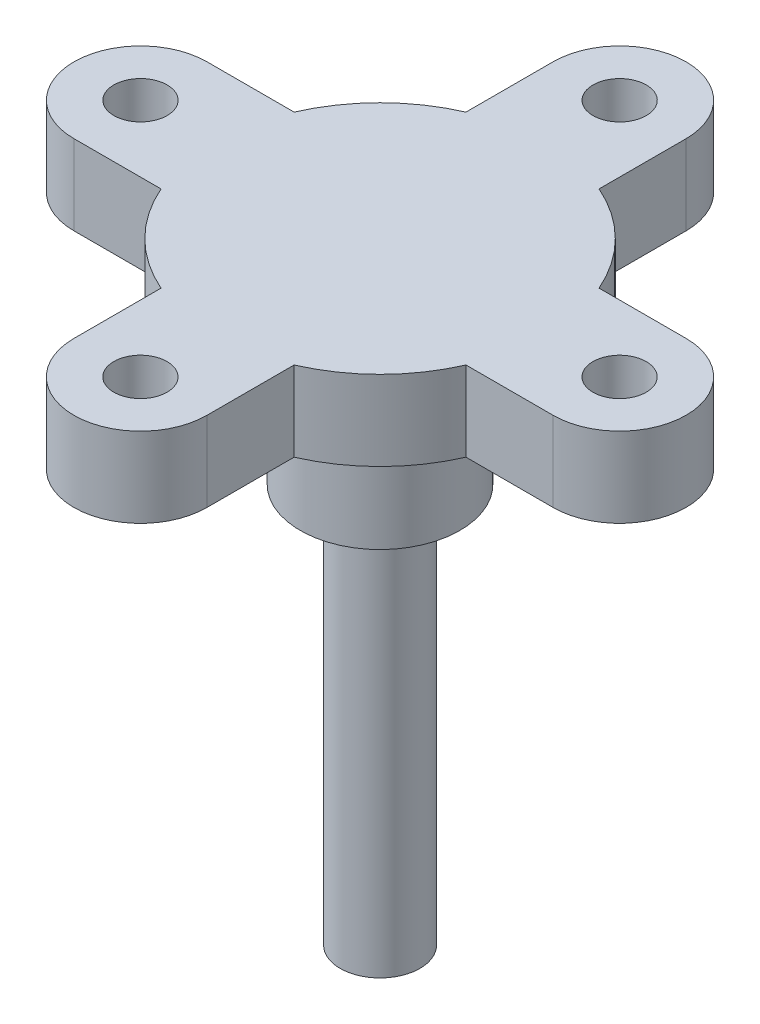
ISO-10303-21;
HEADER;
FILE_DESCRIPTION(('STEP AP214'),'2;1');
FILE_NAME('part.step','',(''),(''),'','','');
FILE_SCHEMA(('AUTOMOTIVE_DESIGN { 1 0 10303 214 1 1 1 1 }'));
ENDSEC;
DATA;
#1=APPLICATION_CONTEXT('core data for automotive mechanical design processes');
#2=APPLICATION_PROTOCOL_DEFINITION('international standard','automotive_design',2000,#1);
#3=PRODUCT_CONTEXT('',#1,'mechanical');
#4=PRODUCT('Part','Part','',(#3));
#5=PRODUCT_RELATED_PRODUCT_CATEGORY('part','',(#4));
#6=PRODUCT_DEFINITION_FORMATION('','',#4);
#7=PRODUCT_DEFINITION_CONTEXT('part definition',#1,'design');
#8=PRODUCT_DEFINITION('design','',#6,#7);
#9=PRODUCT_DEFINITION_SHAPE('','',#8);
#10=(LENGTH_UNIT() NAMED_UNIT(*) SI_UNIT(.MILLI.,.METRE.));
#11=(NAMED_UNIT(*) PLANE_ANGLE_UNIT() SI_UNIT($,.RADIAN.));
#12=(NAMED_UNIT(*) SI_UNIT($,.STERADIAN.) SOLID_ANGLE_UNIT());
#13=UNCERTAINTY_MEASURE_WITH_UNIT(LENGTH_MEASURE(1.E-05),#10,'distance_accuracy_value','');
#14=(GEOMETRIC_REPRESENTATION_CONTEXT(3) GLOBAL_UNCERTAINTY_ASSIGNED_CONTEXT((#13)) GLOBAL_UNIT_ASSIGNED_CONTEXT((#10,
#11,#12)) REPRESENTATION_CONTEXT('',''));
#15=CARTESIAN_POINT('',(0.,0.,0.));
#16=DIRECTION('',(0.,0.,1.));
#17=DIRECTION('',(1.,0.,0.));
#18=AXIS2_PLACEMENT_3D('',#15,#16,#17);
#19=CARTESIAN_POINT('',(-0.000427746550133779,-281.127907150294,0.0033078069265437));
#20=DIRECTION('',(0.,-1.,0.));
#21=DIRECTION('',(0.,0.,-1.));
#22=AXIS2_PLACEMENT_3D('',#19,#20,#21);
#23=PLANE('',#22);
#24=CARTESIAN_POINT('',(-0.000427746550133779,-281.127907150294,0.00330780692654162));
#25=DIRECTION('',(0.,-1.,0.));
#26=DIRECTION('',(0.,0.,-1.));
#27=AXIS2_PLACEMENT_3D('',#24,#25,#26);
#28=CIRCLE('',#27,9.);
#29=CARTESIAN_POINT('',(-0.000427746550133779,-281.127907150294,-8.99669219307346));
#30=VERTEX_POINT('',#29);
#31=EDGE_CURVE('E509',#30,#30,#28,.T.);
#32=ORIENTED_EDGE('',*,*,#31,.F.);
#33=EDGE_LOOP('',(#32));
#34=FACE_BOUND('',#33,.T.);
#35=CARTESIAN_POINT('',(0.00806534663140095,-281.127907150294,-26.9966921930729));
#36=DIRECTION('',(0.,-1.,0.));
#37=DIRECTION('',(0.,0.,-1.));
#38=AXIS2_PLACEMENT_3D('',#35,#36,#37);
#39=CIRCLE('',#38,3.);
#40=CARTESIAN_POINT('',(0.00806534663140095,-281.127907150294,-29.9966921930729));
#41=VERTEX_POINT('',#40);
#42=EDGE_CURVE('E489',#41,#41,#39,.T.);
#43=ORIENTED_EDGE('',*,*,#42,.F.);
#44=EDGE_LOOP('',(#43));
#45=FACE_BOUND('',#44,.T.);
#46=CARTESIAN_POINT('',(-0.000427746550133779,-281.127907150294,27.0118009001086));
#47=DIRECTION('',(0.,-1.,0.));
#48=DIRECTION('',(0.,0.,-1.));
#49=AXIS2_PLACEMENT_3D('',#46,#47,#48);
#50=CIRCLE('',#49,3.);
#51=CARTESIAN_POINT('',(-0.000427746550133779,-281.127907150294,24.0118009001086));
#52=VERTEX_POINT('',#51);
#53=EDGE_CURVE('E221',#52,#52,#50,.T.);
#54=ORIENTED_EDGE('',*,*,#53,.F.);
#55=EDGE_LOOP('',(#54));
#56=FACE_BOUND('',#55,.T.);
#57=CARTESIAN_POINT('',(-0.000427746550133779,-281.127907150294,0.0033078069265437));
#58=DIRECTION('',(0.,-1.,0.));
#59=DIRECTION('',(0.,0.,-1.));
#60=AXIS2_PLACEMENT_3D('',#57,#58,#59);
#61=CIRCLE('',#60,18.75);
#62=CARTESIAN_POINT('',(7.49957225344975,-281.127907150294,-17.1813510491579));
#63=VERTEX_POINT('',#62);
#64=CARTESIAN_POINT('',(17.1842311095342,-281.127907150294,-7.49669219307352));
#65=VERTEX_POINT('',#64);
#66=EDGE_CURVE('E263',#63,#65,#61,.T.);
#67=ORIENTED_EDGE('',*,*,#66,.T.);
#68=DIRECTION('',(1.,0.,0.));
#69=VECTOR('',#68,1.);
#70=CARTESIAN_POINT('',(17.1842311095342,-281.127907150294,-7.49669219307352));
#71=LINE('',#70,#69);
#72=CARTESIAN_POINT('',(26.9995722534498,-281.127907150294,-7.49669219307355));
#73=VERTEX_POINT('',#72);
#74=EDGE_CURVE('E151',#65,#73,#71,.T.);
#75=ORIENTED_EDGE('',*,*,#74,.T.);
#76=CARTESIAN_POINT('',(26.9995722534499,-281.127907150294,0.00330780692616454));
#77=DIRECTION('',(0.,-1.,0.));
#78=DIRECTION('',(0.,0.,-1.));
#79=AXIS2_PLACEMENT_3D('',#76,#77,#78);
#80=CIRCLE('',#79,7.5);
#81=CARTESIAN_POINT('',(26.9995722534499,-281.127907150294,7.50330780692616));
#82=VERTEX_POINT('',#81);
#83=EDGE_CURVE('E414',#73,#82,#80,.T.);
#84=ORIENTED_EDGE('',*,*,#83,.T.);
#85=DIRECTION('',(-1.,0.,0.));
#86=VECTOR('',#85,1.);
#87=CARTESIAN_POINT('',(17.1842311095343,-281.127907150294,7.50330780692648));
#88=LINE('',#87,#86);
#89=CARTESIAN_POINT('',(17.1842311095343,-281.127907150294,7.50330780692648));
#90=VERTEX_POINT('',#89);
#91=EDGE_CURVE('E417',#82,#90,#88,.T.);
#92=ORIENTED_EDGE('',*,*,#91,.T.);
#93=CARTESIAN_POINT('',(-0.000427746550133779,-281.127907150294,0.0033078069265437));
#94=DIRECTION('',(0.,-1.,0.));
#95=DIRECTION('',(0.,0.,-1.));
#96=AXIS2_PLACEMENT_3D('',#93,#94,#95);
#97=CIRCLE('',#96,18.75);
#98=CARTESIAN_POINT('',(7.49957225344987,-281.127907150294,17.1879666630109));
#99=VERTEX_POINT('',#98);
#100=EDGE_CURVE('E421',#90,#99,#97,.T.);
#101=ORIENTED_EDGE('',*,*,#100,.T.);
#102=DIRECTION('',(0.,0.,1.));
#103=VECTOR('',#102,1.);
#104=CARTESIAN_POINT('',(7.49957225344987,-281.127907150294,17.1879666630109));
#105=LINE('',#104,#103);
#106=CARTESIAN_POINT('',(7.49957225344987,-281.127907150294,27.0033078068387));
#107=VERTEX_POINT('',#106);
#108=EDGE_CURVE('E428',#99,#107,#105,.T.);
#109=ORIENTED_EDGE('',*,*,#108,.T.);
#110=CARTESIAN_POINT('',(-0.000427746550085093,-281.127907150294,27.0118009001086));
#111=DIRECTION('',(0.,-1.,0.));
#112=DIRECTION('',(0.,0.,-1.));
#113=AXIS2_PLACEMENT_3D('',#110,#111,#112);
#114=CIRCLE('',#113,7.50000480884063);
#115=CARTESIAN_POINT('',(-7.50042774655014,-281.127907150294,27.0033078069265));
#116=VERTEX_POINT('',#115);
#117=EDGE_CURVE('E431',#107,#116,#114,.T.);
#118=ORIENTED_EDGE('',*,*,#117,.T.);
#119=DIRECTION('',(0.,0.,-1.));
#120=VECTOR('',#119,1.);
#121=CARTESIAN_POINT('',(-7.50042774655013,-281.127907150294,17.1879666630109));
#122=LINE('',#121,#120);
#123=CARTESIAN_POINT('',(-7.50042774655013,-281.127907150294,17.1879666630109));
#124=VERTEX_POINT('',#123);
#125=EDGE_CURVE('E434',#116,#124,#122,.T.);
#126=ORIENTED_EDGE('',*,*,#125,.T.);
#127=CARTESIAN_POINT('',(-0.000427746550133779,-281.127907150294,0.0033078069265437));
#128=DIRECTION('',(0.,-1.,0.));
#129=DIRECTION('',(0.,0.,-1.));
#130=AXIS2_PLACEMENT_3D('',#127,#128,#129);
#131=CIRCLE('',#130,18.75);
#132=CARTESIAN_POINT('',(-17.1850866026345,-281.127907150294,7.50330780692673));
#133=VERTEX_POINT('',#132);
#134=EDGE_CURVE('E437',#124,#133,#131,.T.);
#135=ORIENTED_EDGE('',*,*,#134,.T.);
#136=DIRECTION('',(-1.,0.,0.));
#137=VECTOR('',#136,1.);
#138=CARTESIAN_POINT('',(-17.1850866026345,-281.127907150294,7.50330780692672));
#139=LINE('',#138,#137);
#140=CARTESIAN_POINT('',(-27.00042774655,-281.127907150294,7.50330780692692));
#141=VERTEX_POINT('',#140);
#142=EDGE_CURVE('E440',#133,#141,#139,.T.);
#143=ORIENTED_EDGE('',*,*,#142,.T.);
#144=CARTESIAN_POINT('',(-27.0004277465501,-281.127907150294,0.00330780692710724));
#145=DIRECTION('',(0.,-1.,0.));
#146=DIRECTION('',(0.,0.,-1.));
#147=AXIS2_PLACEMENT_3D('',#144,#145,#146);
#148=CIRCLE('',#147,7.50000000000005);
#149=CARTESIAN_POINT('',(-27.0004277465501,-281.127907150294,-7.49669219307294));
#150=VERTEX_POINT('',#149);
#151=EDGE_CURVE('E443',#141,#150,#148,.T.);
#152=ORIENTED_EDGE('',*,*,#151,.T.);
#153=DIRECTION('',(1.,0.,0.));
#154=VECTOR('',#153,1.);
#155=CARTESIAN_POINT('',(-17.1850866026346,-281.127907150294,-7.49669219307328));
#156=LINE('',#155,#154);
#157=CARTESIAN_POINT('',(-17.1850866026346,-281.127907150294,-7.49669219307328));
#158=VERTEX_POINT('',#157);
#159=EDGE_CURVE('E446',#150,#158,#156,.T.);
#160=ORIENTED_EDGE('',*,*,#159,.T.);
#161=CARTESIAN_POINT('',(-0.000427746550133779,-281.127907150294,0.0033078069265437));
#162=DIRECTION('',(0.,-1.,0.));
#163=DIRECTION('',(0.,0.,-1.));
#164=AXIS2_PLACEMENT_3D('',#161,#162,#163);
#165=CIRCLE('',#164,18.75);
#166=CARTESIAN_POINT('',(-7.50042774655026,-281.127907150294,-17.1813510491578));
#167=VERTEX_POINT('',#166);
#168=EDGE_CURVE('E194',#158,#167,#165,.T.);
#169=ORIENTED_EDGE('',*,*,#168,.T.);
#170=DIRECTION('',(0.,0.,-1.));
#171=VECTOR('',#170,1.);
#172=CARTESIAN_POINT('',(-7.50042774655025,-281.127907150294,-17.1813510491578));
#173=LINE('',#172,#171);
#174=CARTESIAN_POINT('',(-7.50042774655032,-281.127907150294,-26.9966921930734));
#175=VERTEX_POINT('',#174);
#176=EDGE_CURVE('E188',#167,#175,#173,.T.);
#177=ORIENTED_EDGE('',*,*,#176,.T.);
#178=CARTESIAN_POINT('',(-0.000427746550605129,-281.127907150294,-26.9966921930735));
#179=DIRECTION('',(0.,-1.,0.));
#180=DIRECTION('',(0.,0.,-1.));
#181=AXIS2_PLACEMENT_3D('',#178,#179,#180);
#182=CIRCLE('',#181,7.5);
#183=CARTESIAN_POINT('',(7.4995722534494,-281.127907150294,-26.9966921930735));
#184=VERTEX_POINT('',#183);
#185=EDGE_CURVE('E192',#175,#184,#182,.T.);
#186=ORIENTED_EDGE('',*,*,#185,.T.);
#187=DIRECTION('',(0.,0.,1.));
#188=VECTOR('',#187,1.);
#189=CARTESIAN_POINT('',(7.49957225344975,-281.127907150294,-17.1813510491579));
#190=LINE('',#189,#188);
#191=EDGE_CURVE('E83',#184,#63,#190,.T.);
#192=ORIENTED_EDGE('',*,*,#191,.T.);
#193=EDGE_LOOP('',(#67,#75,#84,#92,#101,#109,#118,#126,#135,#143,#152,#160,#169,#177,#186,#192));
#194=FACE_BOUND('',#193,.T.);
#195=CARTESIAN_POINT('',(27.0080653466314,-281.127907150294,0.0118009001086267));
#196=DIRECTION('',(0.,-1.,0.));
#197=DIRECTION('',(0.,0.,-1.));
#198=AXIS2_PLACEMENT_3D('',#195,#196,#197);
#199=CIRCLE('',#198,3.);
#200=CARTESIAN_POINT('',(27.0080653466314,-281.127907150294,-2.98819909989138));
#201=VERTEX_POINT('',#200);
#202=EDGE_CURVE('E481',#201,#201,#199,.T.);
#203=ORIENTED_EDGE('',*,*,#202,.F.);
#204=EDGE_LOOP('',(#203));
#205=FACE_BOUND('',#204,.T.);
#206=CARTESIAN_POINT('',(-27.0004277465501,-281.127907150294,0.00330780692710754));
#207=DIRECTION('',(0.,-1.,0.));
#208=DIRECTION('',(0.,0.,-1.));
#209=AXIS2_PLACEMENT_3D('',#206,#207,#208);
#210=CIRCLE('',#209,3.);
#211=CARTESIAN_POINT('',(-27.0004277465501,-281.127907150294,-2.99669219307289));
#212=VERTEX_POINT('',#211);
#213=EDGE_CURVE('E497',#212,#212,#210,.T.);
#214=ORIENTED_EDGE('',*,*,#213,.F.);
#215=EDGE_LOOP('',(#214));
#216=FACE_BOUND('',#215,.T.);
#217=ADVANCED_FACE('F65',(#34,#45,#56,#194,#205,#216),#23,.T.);
#218=CARTESIAN_POINT('',(-0.000427746550134881,-272.127907150294,0.00330780692654481));
#219=DIRECTION('',(0.,-1.,0.));
#220=DIRECTION('',(0.,0.,-1.));
#221=AXIS2_PLACEMENT_3D('',#218,#219,#220);
#222=PLANE('',#221);
#223=CARTESIAN_POINT('',(-0.000427746550134881,-272.127907150294,0.00330780692654481));
#224=DIRECTION('',(0.,-1.,0.));
#225=DIRECTION('',(0.,0.,-1.));
#226=AXIS2_PLACEMENT_3D('',#223,#224,#225);
#227=CIRCLE('',#226,18.75);
#228=CARTESIAN_POINT('',(7.49957225344975,-272.127907150294,-17.1813510491579));
#229=VERTEX_POINT('',#228);
#230=CARTESIAN_POINT('',(17.1842311095342,-272.127907150294,-7.49669219307352));
#231=VERTEX_POINT('',#230);
#232=EDGE_CURVE('E216',#229,#231,#227,.T.);
#233=ORIENTED_EDGE('',*,*,#232,.F.);
#234=DIRECTION('',(0.,0.,1.));
#235=VECTOR('',#234,1.);
#236=CARTESIAN_POINT('',(7.49957225344975,-272.127907150294,-17.1813510491579));
#237=LINE('',#236,#235);
#238=CARTESIAN_POINT('',(7.49957225344939,-272.127907150294,-26.9966921930735));
#239=VERTEX_POINT('',#238);
#240=EDGE_CURVE('E142',#239,#229,#237,.T.);
#241=ORIENTED_EDGE('',*,*,#240,.F.);
#242=CARTESIAN_POINT('',(-0.000427746550606231,-272.127907150294,-26.9966921930735));
#243=DIRECTION('',(0.,-1.,0.));
#244=DIRECTION('',(0.,0.,-1.));
#245=AXIS2_PLACEMENT_3D('',#242,#243,#244);
#246=CIRCLE('',#245,7.5);
#247=CARTESIAN_POINT('',(-7.50042774655032,-272.127907150294,-26.9966921930734));
#248=VERTEX_POINT('',#247);
#249=EDGE_CURVE('E136',#248,#239,#246,.T.);
#250=ORIENTED_EDGE('',*,*,#249,.F.);
#251=DIRECTION('',(0.,0.,-1.));
#252=VECTOR('',#251,1.);
#253=CARTESIAN_POINT('',(-7.50042774655025,-272.127907150294,-17.1813510491578));
#254=LINE('',#253,#252);
#255=CARTESIAN_POINT('',(-7.50042774655026,-272.127907150294,-17.1813510491578));
#256=VERTEX_POINT('',#255);
#257=EDGE_CURVE('E203',#256,#248,#254,.T.);
#258=ORIENTED_EDGE('',*,*,#257,.F.);
#259=CARTESIAN_POINT('',(-0.000427746550134881,-272.127907150294,0.00330780692654481));
#260=DIRECTION('',(0.,-1.,0.));
#261=DIRECTION('',(0.,0.,-1.));
#262=AXIS2_PLACEMENT_3D('',#259,#260,#261);
#263=CIRCLE('',#262,18.75);
#264=CARTESIAN_POINT('',(-17.1850866026346,-272.127907150294,-7.49669219307328));
#265=VERTEX_POINT('',#264);
#266=EDGE_CURVE('E254',#265,#256,#263,.T.);
#267=ORIENTED_EDGE('',*,*,#266,.F.);
#268=DIRECTION('',(1.,0.,0.));
#269=VECTOR('',#268,1.);
#270=CARTESIAN_POINT('',(-17.1850866026346,-272.127907150294,-7.49669219307328));
#271=LINE('',#270,#269);
#272=CARTESIAN_POINT('',(-27.0004277465501,-272.127907150294,-7.49669219307294));
#273=VERTEX_POINT('',#272);
#274=EDGE_CURVE('E251',#273,#265,#271,.T.);
#275=ORIENTED_EDGE('',*,*,#274,.F.);
#276=CARTESIAN_POINT('',(-27.0004277465501,-272.127907150294,0.00330780692710834));
#277=DIRECTION('',(0.,-1.,0.));
#278=DIRECTION('',(0.,0.,-1.));
#279=AXIS2_PLACEMENT_3D('',#276,#277,#278);
#280=CIRCLE('',#279,7.50000000000005);
#281=CARTESIAN_POINT('',(-27.00042774655,-272.127907150294,7.50330780692693));
#282=VERTEX_POINT('',#281);
#283=EDGE_CURVE('E248',#282,#273,#280,.T.);
#284=ORIENTED_EDGE('',*,*,#283,.F.);
#285=DIRECTION('',(-1.,0.,0.));
#286=VECTOR('',#285,1.);
#287=CARTESIAN_POINT('',(-17.1850866026345,-272.127907150294,7.50330780692672));
#288=LINE('',#287,#286);
#289=CARTESIAN_POINT('',(-17.1850866026345,-272.127907150294,7.50330780692673));
#290=VERTEX_POINT('',#289);
#291=EDGE_CURVE('E245',#290,#282,#288,.T.);
#292=ORIENTED_EDGE('',*,*,#291,.F.);
#293=CARTESIAN_POINT('',(-0.000427746550134881,-272.127907150294,0.00330780692654481));
#294=DIRECTION('',(0.,-1.,0.));
#295=DIRECTION('',(0.,0.,-1.));
#296=AXIS2_PLACEMENT_3D('',#293,#294,#295);
#297=CIRCLE('',#296,18.75);
#298=CARTESIAN_POINT('',(-7.50042774655013,-272.127907150294,17.1879666630109));
#299=VERTEX_POINT('',#298);
#300=EDGE_CURVE('E242',#299,#290,#297,.T.);
#301=ORIENTED_EDGE('',*,*,#300,.F.);
#302=DIRECTION('',(0.,0.,-1.));
#303=VECTOR('',#302,1.);
#304=CARTESIAN_POINT('',(-7.50042774655013,-272.127907150294,17.1879666630109));
#305=LINE('',#304,#303);
#306=CARTESIAN_POINT('',(-7.50042774655014,-272.127907150294,27.0033078069265));
#307=VERTEX_POINT('',#306);
#308=EDGE_CURVE('E239',#307,#299,#305,.T.);
#309=ORIENTED_EDGE('',*,*,#308,.F.);
#310=CARTESIAN_POINT('',(-0.000427746550086195,-272.127907150294,27.0118009001086));
#311=DIRECTION('',(0.,-1.,0.));
#312=DIRECTION('',(0.,0.,-1.));
#313=AXIS2_PLACEMENT_3D('',#310,#311,#312);
#314=CIRCLE('',#313,7.50000480884063);
#315=CARTESIAN_POINT('',(7.49957225344987,-272.127907150294,27.0033078068387));
#316=VERTEX_POINT('',#315);
#317=EDGE_CURVE('E236',#316,#307,#314,.T.);
#318=ORIENTED_EDGE('',*,*,#317,.F.);
#319=DIRECTION('',(0.,0.,1.));
#320=VECTOR('',#319,1.);
#321=CARTESIAN_POINT('',(7.49957225344987,-272.127907150294,17.1879666630109));
#322=LINE('',#321,#320);
#323=CARTESIAN_POINT('',(7.49957225344986,-272.127907150294,17.1879666630109));
#324=VERTEX_POINT('',#323);
#325=EDGE_CURVE('E233',#324,#316,#322,.T.);
#326=ORIENTED_EDGE('',*,*,#325,.F.);
#327=CARTESIAN_POINT('',(-0.000427746550134881,-272.127907150294,0.00330780692654481));
#328=DIRECTION('',(0.,-1.,0.));
#329=DIRECTION('',(0.,0.,-1.));
#330=AXIS2_PLACEMENT_3D('',#327,#328,#329);
#331=CIRCLE('',#330,18.75);
#332=CARTESIAN_POINT('',(17.1842311095343,-272.127907150294,7.50330780692648));
#333=VERTEX_POINT('',#332);
#334=EDGE_CURVE('E230',#333,#324,#331,.T.);
#335=ORIENTED_EDGE('',*,*,#334,.F.);
#336=DIRECTION('',(-1.,0.,0.));
#337=VECTOR('',#336,1.);
#338=CARTESIAN_POINT('',(17.1842311095343,-272.127907150294,7.50330780692648));
#339=LINE('',#338,#337);
#340=CARTESIAN_POINT('',(26.9995722534499,-272.127907150294,7.50330780692617));
#341=VERTEX_POINT('',#340);
#342=EDGE_CURVE('E227',#341,#333,#339,.T.);
#343=ORIENTED_EDGE('',*,*,#342,.F.);
#344=CARTESIAN_POINT('',(26.9995722534499,-272.127907150294,0.00330780692616564));
#345=DIRECTION('',(0.,-1.,0.));
#346=DIRECTION('',(0.,0.,-1.));
#347=AXIS2_PLACEMENT_3D('',#344,#345,#346);
#348=CIRCLE('',#347,7.5);
#349=CARTESIAN_POINT('',(26.9995722534498,-272.127907150294,-7.49669219307355));
#350=VERTEX_POINT('',#349);
#351=EDGE_CURVE('E224',#350,#341,#348,.T.);
#352=ORIENTED_EDGE('',*,*,#351,.F.);
#353=DIRECTION('',(1.,0.,0.));
#354=VECTOR('',#353,1.);
#355=CARTESIAN_POINT('',(17.1842311095342,-272.127907150294,-7.49669219307352));
#356=LINE('',#355,#354);
#357=EDGE_CURVE('E220',#231,#350,#356,.T.);
#358=ORIENTED_EDGE('',*,*,#357,.F.);
#359=EDGE_LOOP('',(#233,#241,#250,#258,#267,#275,#284,#292,#301,#309,#318,#326,#335,#343,#352,#358));
#360=FACE_BOUND('',#359,.T.);
#361=CARTESIAN_POINT('',(-0.000427746550134881,-272.127907150294,27.0118009001086));
#362=DIRECTION('',(0.,-1.,0.));
#363=DIRECTION('',(0.,0.,-1.));
#364=AXIS2_PLACEMENT_3D('',#361,#362,#363);
#365=CIRCLE('',#364,3.);
#366=CARTESIAN_POINT('',(-0.000427746550134881,-272.127907150294,24.0118009001086));
#367=VERTEX_POINT('',#366);
#368=EDGE_CURVE('E477',#367,#367,#365,.T.);
#369=ORIENTED_EDGE('',*,*,#368,.T.);
#370=EDGE_LOOP('',(#369));
#371=FACE_BOUND('',#370,.T.);
#372=CARTESIAN_POINT('',(27.0080653466314,-272.127907150294,0.0118009001086278));
#373=DIRECTION('',(0.,-1.,0.));
#374=DIRECTION('',(0.,0.,-1.));
#375=AXIS2_PLACEMENT_3D('',#372,#373,#374);
#376=CIRCLE('',#375,3.);
#377=CARTESIAN_POINT('',(27.0080653466314,-272.127907150294,-2.98819909989137));
#378=VERTEX_POINT('',#377);
#379=EDGE_CURVE('E485',#378,#378,#376,.T.);
#380=ORIENTED_EDGE('',*,*,#379,.T.);
#381=EDGE_LOOP('',(#380));
#382=FACE_BOUND('',#381,.T.);
#383=CARTESIAN_POINT('',(0.00806534663139985,-272.127907150294,-26.9966921930729));
#384=DIRECTION('',(0.,-1.,0.));
#385=DIRECTION('',(0.,0.,-1.));
#386=AXIS2_PLACEMENT_3D('',#383,#384,#385);
#387=CIRCLE('',#386,3.);
#388=CARTESIAN_POINT('',(0.00806534663139985,-272.127907150294,-29.9966921930729));
#389=VERTEX_POINT('',#388);
#390=EDGE_CURVE('E493',#389,#389,#387,.T.);
#391=ORIENTED_EDGE('',*,*,#390,.T.);
#392=EDGE_LOOP('',(#391));
#393=FACE_BOUND('',#392,.T.);
#394=CARTESIAN_POINT('',(-27.0004277465501,-272.127907150294,0.00330780692710864));
#395=DIRECTION('',(0.,-1.,0.));
#396=DIRECTION('',(0.,0.,-1.));
#397=AXIS2_PLACEMENT_3D('',#394,#395,#396);
#398=CIRCLE('',#397,3.);
#399=CARTESIAN_POINT('',(-27.0004277465501,-272.127907150294,-2.99669219307289));
#400=VERTEX_POINT('',#399);
#401=EDGE_CURVE('E501',#400,#400,#398,.T.);
#402=ORIENTED_EDGE('',*,*,#401,.T.);
#403=EDGE_LOOP('',(#402));
#404=FACE_BOUND('',#403,.T.);
#405=ADVANCED_FACE('F334',(#360,#371,#382,#393,#404),#222,.F.);
#406=CARTESIAN_POINT('',(-0.000427746550133779,-281.127907150294,0.0033078069265437));
#407=DIRECTION('',(0.,1.,0.));
#408=DIRECTION('',(0.,0.,1.));
#409=AXIS2_PLACEMENT_3D('',#406,#407,#408);
#410=CYLINDRICAL_SURFACE('',#409,18.75);
#411=ORIENTED_EDGE('',*,*,#232,.T.);
#412=DIRECTION('',(0.,1.,0.));
#413=VECTOR('',#412,1.);
#414=CARTESIAN_POINT('',(17.1842311095342,-281.127907150294,-7.49669219307352));
#415=LINE('',#414,#413);
#416=EDGE_CURVE('E314',#65,#231,#415,.T.);
#417=ORIENTED_EDGE('',*,*,#416,.F.);
#418=ORIENTED_EDGE('',*,*,#66,.F.);
#419=DIRECTION('',(0.,1.,0.));
#420=VECTOR('',#419,1.);
#421=CARTESIAN_POINT('',(7.49957225344975,-281.127907150294,-17.1813510491579));
#422=LINE('',#421,#420);
#423=EDGE_CURVE('E212',#63,#229,#422,.T.);
#424=ORIENTED_EDGE('',*,*,#423,.T.);
#425=EDGE_LOOP('',(#411,#417,#418,#424));
#426=FACE_BOUND('',#425,.T.);
#427=ADVANCED_FACE('F340',(#426),#410,.T.);
#428=CARTESIAN_POINT('',(17.1842311095342,-281.127907150294,-7.49669219307352));
#429=DIRECTION('',(0.,0.,1.));
#430=DIRECTION('',(1.,0.,0.));
#431=AXIS2_PLACEMENT_3D('',#428,#429,#430);
#432=PLANE('',#431);
#433=ORIENTED_EDGE('',*,*,#357,.T.);
#434=DIRECTION('',(0.,1.,0.));
#435=VECTOR('',#434,1.);
#436=CARTESIAN_POINT('',(26.9995722534498,-281.127907150294,-7.49669219307355));
#437=LINE('',#436,#435);
#438=EDGE_CURVE('E310',#73,#350,#437,.T.);
#439=ORIENTED_EDGE('',*,*,#438,.F.);
#440=ORIENTED_EDGE('',*,*,#74,.F.);
#441=ORIENTED_EDGE('',*,*,#416,.T.);
#442=EDGE_LOOP('',(#433,#439,#440,#441));
#443=FACE_BOUND('',#442,.T.);
#444=ADVANCED_FACE('F399',(#443),#432,.F.);
#445=CARTESIAN_POINT('',(26.9995722534499,-281.127907150294,0.00330780692616454));
#446=DIRECTION('',(0.,1.,0.));
#447=DIRECTION('',(0.,0.,1.));
#448=AXIS2_PLACEMENT_3D('',#445,#446,#447);
#449=CYLINDRICAL_SURFACE('',#448,7.5);
#450=ORIENTED_EDGE('',*,*,#351,.T.);
#451=DIRECTION('',(0.,1.,0.));
#452=VECTOR('',#451,1.);
#453=CARTESIAN_POINT('',(26.9995722534499,-281.127907150294,7.50330780692616));
#454=LINE('',#453,#452);
#455=EDGE_CURVE('E306',#82,#341,#454,.T.);
#456=ORIENTED_EDGE('',*,*,#455,.F.);
#457=ORIENTED_EDGE('',*,*,#83,.F.);
#458=ORIENTED_EDGE('',*,*,#438,.T.);
#459=EDGE_LOOP('',(#450,#456,#457,#458));
#460=FACE_BOUND('',#459,.T.);
#461=ADVANCED_FACE('F395',(#460),#449,.T.);
#462=CARTESIAN_POINT('',(17.1842311095343,-281.127907150294,7.50330780692648));
#463=DIRECTION('',(0.,0.,-1.));
#464=DIRECTION('',(-1.,0.,0.));
#465=AXIS2_PLACEMENT_3D('',#462,#463,#464);
#466=PLANE('',#465);
#467=ORIENTED_EDGE('',*,*,#342,.T.);
#468=DIRECTION('',(0.,1.,0.));
#469=VECTOR('',#468,1.);
#470=CARTESIAN_POINT('',(17.1842311095343,-281.127907150294,7.50330780692648));
#471=LINE('',#470,#469);
#472=EDGE_CURVE('E302',#90,#333,#471,.T.);
#473=ORIENTED_EDGE('',*,*,#472,.F.);
#474=ORIENTED_EDGE('',*,*,#91,.F.);
#475=ORIENTED_EDGE('',*,*,#455,.T.);
#476=EDGE_LOOP('',(#467,#473,#474,#475));
#477=FACE_BOUND('',#476,.T.);
#478=ADVANCED_FACE('F391',(#477),#466,.F.);
#479=CARTESIAN_POINT('',(-0.000427746550133779,-281.127907150294,0.0033078069265437));
#480=DIRECTION('',(0.,1.,0.));
#481=DIRECTION('',(0.,0.,1.));
#482=AXIS2_PLACEMENT_3D('',#479,#480,#481);
#483=CYLINDRICAL_SURFACE('',#482,18.75);
#484=ORIENTED_EDGE('',*,*,#334,.T.);
#485=DIRECTION('',(0.,1.,0.));
#486=VECTOR('',#485,1.);
#487=CARTESIAN_POINT('',(7.49957225344987,-281.127907150294,17.1879666630109));
#488=LINE('',#487,#486);
#489=EDGE_CURVE('E298',#99,#324,#488,.T.);
#490=ORIENTED_EDGE('',*,*,#489,.F.);
#491=ORIENTED_EDGE('',*,*,#100,.F.);
#492=ORIENTED_EDGE('',*,*,#472,.T.);
#493=EDGE_LOOP('',(#484,#490,#491,#492));
#494=FACE_BOUND('',#493,.T.);
#495=ADVANCED_FACE('F387',(#494),#483,.T.);
#496=CARTESIAN_POINT('',(7.49957225344987,-281.127907150294,17.1879666630109));
#497=DIRECTION('',(-1.,0.,0.));
#498=DIRECTION('',(0.,-1.,0.));
#499=AXIS2_PLACEMENT_3D('',#496,#497,#498);
#500=PLANE('',#499);
#501=ORIENTED_EDGE('',*,*,#325,.T.);
#502=DIRECTION('',(0.,1.,0.));
#503=VECTOR('',#502,1.);
#504=CARTESIAN_POINT('',(7.49957225344987,-281.127907150294,27.0033078068387));
#505=LINE('',#504,#503);
#506=EDGE_CURVE('E294',#107,#316,#505,.T.);
#507=ORIENTED_EDGE('',*,*,#506,.F.);
#508=ORIENTED_EDGE('',*,*,#108,.F.);
#509=ORIENTED_EDGE('',*,*,#489,.T.);
#510=EDGE_LOOP('',(#501,#507,#508,#509));
#511=FACE_BOUND('',#510,.T.);
#512=ADVANCED_FACE('F383',(#511),#500,.F.);
#513=CARTESIAN_POINT('',(-0.000427746550085093,-281.127907150294,27.0118009001086));
#514=DIRECTION('',(0.,1.,0.));
#515=DIRECTION('',(0.,0.,1.));
#516=AXIS2_PLACEMENT_3D('',#513,#514,#515);
#517=CYLINDRICAL_SURFACE('',#516,7.50000480884063);
#518=ORIENTED_EDGE('',*,*,#317,.T.);
#519=DIRECTION('',(0.,1.,0.));
#520=VECTOR('',#519,1.);
#521=CARTESIAN_POINT('',(-7.50042774655014,-281.127907150294,27.0033078069265));
#522=LINE('',#521,#520);
#523=EDGE_CURVE('E290',#116,#307,#522,.T.);
#524=ORIENTED_EDGE('',*,*,#523,.F.);
#525=ORIENTED_EDGE('',*,*,#117,.F.);
#526=ORIENTED_EDGE('',*,*,#506,.T.);
#527=EDGE_LOOP('',(#518,#524,#525,#526));
#528=FACE_BOUND('',#527,.T.);
#529=ADVANCED_FACE('F379',(#528),#517,.T.);
#530=CARTESIAN_POINT('',(-7.50042774655013,-281.127907150294,17.1879666630109));
#531=DIRECTION('',(1.,0.,0.));
#532=DIRECTION('',(0.,1.,0.));
#533=AXIS2_PLACEMENT_3D('',#530,#531,#532);
#534=PLANE('',#533);
#535=ORIENTED_EDGE('',*,*,#308,.T.);
#536=DIRECTION('',(0.,1.,0.));
#537=VECTOR('',#536,1.);
#538=CARTESIAN_POINT('',(-7.50042774655013,-281.127907150294,17.1879666630109));
#539=LINE('',#538,#537);
#540=EDGE_CURVE('E286',#124,#299,#539,.T.);
#541=ORIENTED_EDGE('',*,*,#540,.F.);
#542=ORIENTED_EDGE('',*,*,#125,.F.);
#543=ORIENTED_EDGE('',*,*,#523,.T.);
#544=EDGE_LOOP('',(#535,#541,#542,#543));
#545=FACE_BOUND('',#544,.T.);
#546=ADVANCED_FACE('F375',(#545),#534,.F.);
#547=CARTESIAN_POINT('',(-0.000427746550133779,-281.127907150294,0.0033078069265437));
#548=DIRECTION('',(0.,1.,0.));
#549=DIRECTION('',(0.,0.,1.));
#550=AXIS2_PLACEMENT_3D('',#547,#548,#549);
#551=CYLINDRICAL_SURFACE('',#550,18.75);
#552=ORIENTED_EDGE('',*,*,#300,.T.);
#553=DIRECTION('',(0.,1.,0.));
#554=VECTOR('',#553,1.);
#555=CARTESIAN_POINT('',(-17.1850866026345,-281.127907150294,7.50330780692673));
#556=LINE('',#555,#554);
#557=EDGE_CURVE('E282',#133,#290,#556,.T.);
#558=ORIENTED_EDGE('',*,*,#557,.F.);
#559=ORIENTED_EDGE('',*,*,#134,.F.);
#560=ORIENTED_EDGE('',*,*,#540,.T.);
#561=EDGE_LOOP('',(#552,#558,#559,#560));
#562=FACE_BOUND('',#561,.T.);
#563=ADVANCED_FACE('F371',(#562),#551,.T.);
#564=CARTESIAN_POINT('',(-17.1850866026345,-281.127907150294,7.50330780692672));
#565=DIRECTION('',(0.,0.,-1.));
#566=DIRECTION('',(-1.,0.,0.));
#567=AXIS2_PLACEMENT_3D('',#564,#565,#566);
#568=PLANE('',#567);
#569=ORIENTED_EDGE('',*,*,#291,.T.);
#570=DIRECTION('',(0.,1.,0.));
#571=VECTOR('',#570,1.);
#572=CARTESIAN_POINT('',(-27.00042774655,-281.127907150294,7.50330780692692));
#573=LINE('',#572,#571);
#574=EDGE_CURVE('E278',#141,#282,#573,.T.);
#575=ORIENTED_EDGE('',*,*,#574,.F.);
#576=ORIENTED_EDGE('',*,*,#142,.F.);
#577=ORIENTED_EDGE('',*,*,#557,.T.);
#578=EDGE_LOOP('',(#569,#575,#576,#577));
#579=FACE_BOUND('',#578,.T.);
#580=ADVANCED_FACE('F367',(#579),#568,.F.);
#581=CARTESIAN_POINT('',(-27.0004277465501,-281.127907150294,0.00330780692710724));
#582=DIRECTION('',(0.,1.,0.));
#583=DIRECTION('',(0.,0.,1.));
#584=AXIS2_PLACEMENT_3D('',#581,#582,#583);
#585=CYLINDRICAL_SURFACE('',#584,7.50000000000005);
#586=ORIENTED_EDGE('',*,*,#283,.T.);
#587=DIRECTION('',(0.,1.,0.));
#588=VECTOR('',#587,1.);
#589=CARTESIAN_POINT('',(-27.0004277465501,-281.127907150294,-7.49669219307294));
#590=LINE('',#589,#588);
#591=EDGE_CURVE('E274',#150,#273,#590,.T.);
#592=ORIENTED_EDGE('',*,*,#591,.F.);
#593=ORIENTED_EDGE('',*,*,#151,.F.);
#594=ORIENTED_EDGE('',*,*,#574,.T.);
#595=EDGE_LOOP('',(#586,#592,#593,#594));
#596=FACE_BOUND('',#595,.T.);
#597=ADVANCED_FACE('F363',(#596),#585,.T.);
#598=CARTESIAN_POINT('',(-17.1850866026346,-281.127907150294,-7.49669219307328));
#599=DIRECTION('',(0.,0.,1.));
#600=DIRECTION('',(1.,0.,0.));
#601=AXIS2_PLACEMENT_3D('',#598,#599,#600);
#602=PLANE('',#601);
#603=ORIENTED_EDGE('',*,*,#274,.T.);
#604=DIRECTION('',(0.,1.,0.));
#605=VECTOR('',#604,1.);
#606=CARTESIAN_POINT('',(-17.1850866026346,-281.127907150294,-7.49669219307328));
#607=LINE('',#606,#605);
#608=EDGE_CURVE('E270',#158,#265,#607,.T.);
#609=ORIENTED_EDGE('',*,*,#608,.F.);
#610=ORIENTED_EDGE('',*,*,#159,.F.);
#611=ORIENTED_EDGE('',*,*,#591,.T.);
#612=EDGE_LOOP('',(#603,#609,#610,#611));
#613=FACE_BOUND('',#612,.T.);
#614=ADVANCED_FACE('F359',(#613),#602,.F.);
#615=CARTESIAN_POINT('',(-0.000427746550133779,-281.127907150294,0.0033078069265437));
#616=DIRECTION('',(0.,1.,0.));
#617=DIRECTION('',(0.,0.,1.));
#618=AXIS2_PLACEMENT_3D('',#615,#616,#617);
#619=CYLINDRICAL_SURFACE('',#618,18.75);
#620=ORIENTED_EDGE('',*,*,#266,.T.);
#621=DIRECTION('',(0.,1.,0.));
#622=VECTOR('',#621,1.);
#623=CARTESIAN_POINT('',(-7.50042774655026,-281.127907150294,-17.1813510491578));
#624=LINE('',#623,#622);
#625=EDGE_CURVE('E205',#167,#256,#624,.T.);
#626=ORIENTED_EDGE('',*,*,#625,.F.);
#627=ORIENTED_EDGE('',*,*,#168,.F.);
#628=ORIENTED_EDGE('',*,*,#608,.T.);
#629=EDGE_LOOP('',(#620,#626,#627,#628));
#630=FACE_BOUND('',#629,.T.);
#631=ADVANCED_FACE('F356',(#630),#619,.T.);
#632=CARTESIAN_POINT('',(-7.50042774655025,-281.127907150294,-17.1813510491578));
#633=DIRECTION('',(1.,0.,0.));
#634=DIRECTION('',(0.,0.,-1.));
#635=AXIS2_PLACEMENT_3D('',#632,#633,#634);
#636=PLANE('',#635);
#637=ORIENTED_EDGE('',*,*,#257,.T.);
#638=DIRECTION('',(0.,1.,0.));
#639=VECTOR('',#638,1.);
#640=CARTESIAN_POINT('',(-7.50042774655032,-281.127907150294,-26.9966921930734));
#641=LINE('',#640,#639);
#642=EDGE_CURVE('E200',#175,#248,#641,.T.);
#643=ORIENTED_EDGE('',*,*,#642,.F.);
#644=ORIENTED_EDGE('',*,*,#176,.F.);
#645=ORIENTED_EDGE('',*,*,#625,.T.);
#646=EDGE_LOOP('',(#637,#643,#644,#645));
#647=FACE_BOUND('',#646,.T.);
#648=ADVANCED_FACE('F201',(#647),#636,.F.);
#649=CARTESIAN_POINT('',(-0.000427746550605129,-281.127907150294,-26.9966921930735));
#650=DIRECTION('',(0.,1.,0.));
#651=DIRECTION('',(0.,0.,1.));
#652=AXIS2_PLACEMENT_3D('',#649,#650,#651);
#653=CYLINDRICAL_SURFACE('',#652,7.5);
#654=ORIENTED_EDGE('',*,*,#249,.T.);
#655=DIRECTION('',(0.,1.,0.));
#656=VECTOR('',#655,1.);
#657=CARTESIAN_POINT('',(7.4995722534494,-281.127907150294,-26.9966921930735));
#658=LINE('',#657,#656);
#659=EDGE_CURVE('E206',#184,#239,#658,.T.);
#660=ORIENTED_EDGE('',*,*,#659,.F.);
#661=ORIENTED_EDGE('',*,*,#185,.F.);
#662=ORIENTED_EDGE('',*,*,#642,.T.);
#663=EDGE_LOOP('',(#654,#660,#661,#662));
#664=FACE_BOUND('',#663,.T.);
#665=ADVANCED_FACE('F208',(#664),#653,.T.);
#666=CARTESIAN_POINT('',(7.49957225344975,-281.127907150294,-17.1813510491579));
#667=DIRECTION('',(-1.,0.,0.));
#668=DIRECTION('',(0.,0.,1.));
#669=AXIS2_PLACEMENT_3D('',#666,#667,#668);
#670=PLANE('',#669);
#671=ORIENTED_EDGE('',*,*,#240,.T.);
#672=ORIENTED_EDGE('',*,*,#423,.F.);
#673=ORIENTED_EDGE('',*,*,#191,.F.);
#674=ORIENTED_EDGE('',*,*,#659,.T.);
#675=EDGE_LOOP('',(#671,#672,#673,#674));
#676=FACE_BOUND('',#675,.T.);
#677=ADVANCED_FACE('F349',(#676),#670,.F.);
#678=CARTESIAN_POINT('',(-0.000427746550133779,-281.127907150294,27.0118009001086));
#679=DIRECTION('',(0.,1.,0.));
#680=DIRECTION('',(0.,0.,1.));
#681=AXIS2_PLACEMENT_3D('',#678,#679,#680);
#682=CYLINDRICAL_SURFACE('',#681,3.);
#683=ORIENTED_EDGE('',*,*,#53,.T.);
#684=EDGE_LOOP('',(#683));
#685=FACE_BOUND('',#684,.T.);
#686=ORIENTED_EDGE('',*,*,#368,.F.);
#687=EDGE_LOOP('',(#686));
#688=FACE_BOUND('',#687,.T.);
#689=ADVANCED_FACE('F346',(#685,#688),#682,.F.);
#690=CARTESIAN_POINT('',(27.0080653466314,-281.127907150294,0.0118009001086267));
#691=DIRECTION('',(0.,1.,0.));
#692=DIRECTION('',(0.,0.,1.));
#693=AXIS2_PLACEMENT_3D('',#690,#691,#692);
#694=CYLINDRICAL_SURFACE('',#693,3.);
#695=ORIENTED_EDGE('',*,*,#202,.T.);
#696=EDGE_LOOP('',(#695));
#697=FACE_BOUND('',#696,.T.);
#698=ORIENTED_EDGE('',*,*,#379,.F.);
#699=EDGE_LOOP('',(#698));
#700=FACE_BOUND('',#699,.T.);
#701=ADVANCED_FACE('F539',(#697,#700),#694,.F.);
#702=CARTESIAN_POINT('',(0.00806534663140095,-281.127907150294,-26.9966921930729));
#703=DIRECTION('',(0.,1.,0.));
#704=DIRECTION('',(0.,0.,1.));
#705=AXIS2_PLACEMENT_3D('',#702,#703,#704);
#706=CYLINDRICAL_SURFACE('',#705,3.);
#707=ORIENTED_EDGE('',*,*,#42,.T.);
#708=EDGE_LOOP('',(#707));
#709=FACE_BOUND('',#708,.T.);
#710=ORIENTED_EDGE('',*,*,#390,.F.);
#711=EDGE_LOOP('',(#710));
#712=FACE_BOUND('',#711,.T.);
#713=ADVANCED_FACE('F536',(#709,#712),#706,.F.);
#714=CARTESIAN_POINT('',(-27.0004277465501,-281.127907150294,0.00330780692710754));
#715=DIRECTION('',(0.,1.,0.));
#716=DIRECTION('',(0.,0.,1.));
#717=AXIS2_PLACEMENT_3D('',#714,#715,#716);
#718=CYLINDRICAL_SURFACE('',#717,3.);
#719=ORIENTED_EDGE('',*,*,#213,.T.);
#720=EDGE_LOOP('',(#719));
#721=FACE_BOUND('',#720,.T.);
#722=ORIENTED_EDGE('',*,*,#401,.F.);
#723=EDGE_LOOP('',(#722));
#724=FACE_BOUND('',#723,.T.);
#725=ADVANCED_FACE('F532',(#721,#724),#718,.F.);
#726=CARTESIAN_POINT('',(-0.000427746550131942,-296.127907150294,0.00330780692653979));
#727=DIRECTION('',(0.,1.,0.));
#728=DIRECTION('',(0.,0.,1.));
#729=AXIS2_PLACEMENT_3D('',#726,#727,#728);
#730=CYLINDRICAL_SURFACE('',#729,9.);
#731=CARTESIAN_POINT('',(-0.000427746550131942,-296.127907150294,0.00330780692653979));
#732=DIRECTION('',(0.,-1.,0.));
#733=DIRECTION('',(0.,0.,-1.));
#734=AXIS2_PLACEMENT_3D('',#731,#732,#733);
#735=CIRCLE('',#734,9.);
#736=CARTESIAN_POINT('',(-0.000427746550131942,-296.127907150294,-8.99669219307346));
#737=VERTEX_POINT('',#736);
#738=EDGE_CURVE('E505',#737,#737,#735,.T.);
#739=ORIENTED_EDGE('',*,*,#738,.F.);
#740=EDGE_LOOP('',(#739));
#741=FACE_BOUND('',#740,.T.);
#742=ORIENTED_EDGE('',*,*,#31,.T.);
#743=EDGE_LOOP('',(#742));
#744=FACE_BOUND('',#743,.T.);
#745=ADVANCED_FACE('F527',(#741,#744),#730,.T.);
#746=CARTESIAN_POINT('',(-0.000427746550142048,-296.127907150294,0.00330780692654989));
#747=DIRECTION('',(0.,-1.,0.));
#748=DIRECTION('',(0.,0.,-1.));
#749=AXIS2_PLACEMENT_3D('',#746,#747,#748);
#750=PLANE('',#749);
#751=CARTESIAN_POINT('',(-0.000427746550131574,-296.127907150294,0.00330780692653942));
#752=DIRECTION('',(0.,-1.,0.));
#753=DIRECTION('',(0.,0.,-1.));
#754=AXIS2_PLACEMENT_3D('',#751,#752,#753);
#755=CIRCLE('',#754,7.5);
#756=CARTESIAN_POINT('',(-0.000427746550131574,-296.127907150294,-7.49669219307346));
#757=VERTEX_POINT('',#756);
#758=EDGE_CURVE('E75',#757,#757,#755,.F.);
#759=ORIENTED_EDGE('',*,*,#758,.T.);
#760=EDGE_LOOP('',(#759));
#761=FACE_BOUND('',#760,.T.);
#762=ORIENTED_EDGE('',*,*,#738,.T.);
#763=EDGE_LOOP('',(#762));
#764=FACE_BOUND('',#763,.T.);
#765=ADVANCED_FACE('F320',(#761,#764),#750,.T.);
#766=CARTESIAN_POINT('',(-0.000427746550126431,-341.127907150294,0.00330780692653428));
#767=DIRECTION('',(0.,1.,0.));
#768=DIRECTION('',(0.,0.,1.));
#769=AXIS2_PLACEMENT_3D('',#766,#767,#768);
#770=CYLINDRICAL_SURFACE('',#769,4.5);
#771=CARTESIAN_POINT('',(-0.000427746550131574,-299.127907150294,0.00330780692653942));
#772=DIRECTION('',(0.,-1.,0.));
#773=DIRECTION('',(0.,0.,-1.));
#774=AXIS2_PLACEMENT_3D('',#771,#772,#773);
#775=CIRCLE('',#774,4.5);
#776=CARTESIAN_POINT('',(-0.000427746550131574,-299.127907150294,-4.49669219307346));
#777=VERTEX_POINT('',#776);
#778=EDGE_CURVE('E12',#777,#777,#775,.T.);
#779=ORIENTED_EDGE('',*,*,#778,.T.);
#780=EDGE_LOOP('',(#779));
#781=FACE_BOUND('',#780,.T.);
#782=CARTESIAN_POINT('',(-0.000427746550126431,-341.127907150294,0.00330780692653428));
#783=DIRECTION('',(0.,-1.,0.));
#784=DIRECTION('',(0.,0.,-1.));
#785=AXIS2_PLACEMENT_3D('',#782,#783,#784);
#786=CIRCLE('',#785,4.5);
#787=CARTESIAN_POINT('',(-0.000427746550126431,-341.127907150294,-4.49669219307347));
#788=VERTEX_POINT('',#787);
#789=EDGE_CURVE('E513',#788,#788,#786,.T.);
#790=ORIENTED_EDGE('',*,*,#789,.F.);
#791=EDGE_LOOP('',(#790));
#792=FACE_BOUND('',#791,.T.);
#793=ADVANCED_FACE('F329',(#781,#792),#770,.T.);
#794=CARTESIAN_POINT('',(-0.000427746550136537,-341.127907150294,0.00330780692654438));
#795=DIRECTION('',(0.,-1.,0.));
#796=DIRECTION('',(0.,0.,-1.));
#797=AXIS2_PLACEMENT_3D('',#794,#795,#796);
#798=PLANE('',#797);
#799=ORIENTED_EDGE('',*,*,#789,.T.);
#800=EDGE_LOOP('',(#799));
#801=FACE_BOUND('',#800,.T.);
#802=ADVANCED_FACE('F324',(#801),#798,.T.);
#803=CARTESIAN_POINT('',(-0.000427746550131574,-299.127907150294,0.00330780692653942));
#804=DIRECTION('',(0.,-1.,0.));
#805=DIRECTION('',(0.,0.,-1.));
#806=AXIS2_PLACEMENT_3D('',#803,#804,#805);
#807=TOROIDAL_SURFACE('',#806,7.5,3.);
#808=ORIENTED_EDGE('',*,*,#778,.F.);
#809=EDGE_LOOP('',(#808));
#810=FACE_BOUND('',#809,.T.);
#811=ORIENTED_EDGE('',*,*,#758,.F.);
#812=EDGE_LOOP('',(#811));
#813=FACE_BOUND('',#812,.T.);
#814=ADVANCED_FACE('F67',(#810,#813),#807,.F.);
#815=CLOSED_SHELL('',(#217,#405,#427,#444,#461,#478,#495,#512,#529,#546,#563,#580,#597,#614,
#631,#648,#665,#677,#689,#701,#713,#725,#745,#765,#793,#802,#814));
#816=MANIFOLD_SOLID_BREP('B2',#815);
#817=ADVANCED_BREP_SHAPE_REPRESENTATION('',(#18,#816),#14);
#818=SHAPE_DEFINITION_REPRESENTATION(#9,#817);
ENDSEC;
END-ISO-10303-21;
